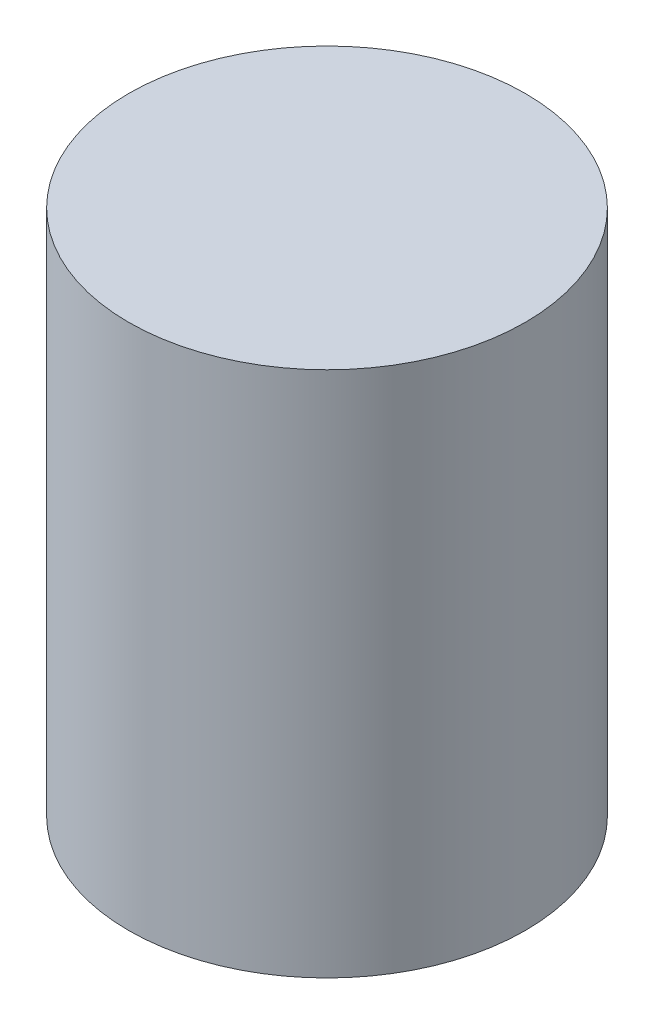
ISO-10303-21;
HEADER;
FILE_DESCRIPTION(('STEP AP214'),'2;1');
FILE_NAME('part.step','',(''),(''),'','','');
FILE_SCHEMA(('AUTOMOTIVE_DESIGN { 1 0 10303 214 1 1 1 1 }'));
ENDSEC;
DATA;
#1=APPLICATION_CONTEXT('core data for automotive mechanical design processes');
#2=APPLICATION_PROTOCOL_DEFINITION('international standard','automotive_design',2000,#1);
#3=PRODUCT_CONTEXT('',#1,'mechanical');
#4=PRODUCT('Part','Part','',(#3));
#5=PRODUCT_RELATED_PRODUCT_CATEGORY('part','',(#4));
#6=PRODUCT_DEFINITION_FORMATION('','',#4);
#7=PRODUCT_DEFINITION_CONTEXT('part definition',#1,'design');
#8=PRODUCT_DEFINITION('design','',#6,#7);
#9=PRODUCT_DEFINITION_SHAPE('','',#8);
#10=(LENGTH_UNIT() NAMED_UNIT(*) SI_UNIT(.MILLI.,.METRE.));
#11=(NAMED_UNIT(*) PLANE_ANGLE_UNIT() SI_UNIT($,.RADIAN.));
#12=(NAMED_UNIT(*) SI_UNIT($,.STERADIAN.) SOLID_ANGLE_UNIT());
#13=UNCERTAINTY_MEASURE_WITH_UNIT(LENGTH_MEASURE(1.E-05),#10,'distance_accuracy_value','');
#14=(GEOMETRIC_REPRESENTATION_CONTEXT(3) GLOBAL_UNCERTAINTY_ASSIGNED_CONTEXT((#13)) GLOBAL_UNIT_ASSIGNED_CONTEXT((#10,
#11,#12)) REPRESENTATION_CONTEXT('',''));
#15=CARTESIAN_POINT('',(0.,0.,0.));
#16=DIRECTION('',(0.,0.,1.));
#17=DIRECTION('',(1.,0.,0.));
#18=AXIS2_PLACEMENT_3D('',#15,#16,#17);
#19=CARTESIAN_POINT('',(0.,131.5,0.));
#20=DIRECTION('',(0.,-1.,0.));
#21=DIRECTION('',(0.,0.,-1.));
#22=AXIS2_PLACEMENT_3D('',#19,#20,#21);
#23=CYLINDRICAL_SURFACE('',#22,99.);
#24=CARTESIAN_POINT('',(0.,131.5,0.));
#25=DIRECTION('',(0.,1.,0.));
#26=DIRECTION('',(0.,0.,1.));
#27=AXIS2_PLACEMENT_3D('',#24,#25,#26);
#28=CIRCLE('',#27,99.);
#29=CARTESIAN_POINT('',(0.,131.5,99.));
#30=VERTEX_POINT('',#29);
#31=EDGE_CURVE('E10',#30,#30,#28,.T.);
#32=ORIENTED_EDGE('',*,*,#31,.F.);
#33=EDGE_LOOP('',(#32));
#34=FACE_BOUND('',#33,.T.);
#35=CARTESIAN_POINT('',(0.,-131.5,0.));
#36=DIRECTION('',(0.,1.,0.));
#37=DIRECTION('',(0.,0.,1.));
#38=AXIS2_PLACEMENT_3D('',#35,#36,#37);
#39=CIRCLE('',#38,99.);
#40=CARTESIAN_POINT('',(0.,-131.5,99.));
#41=VERTEX_POINT('',#40);
#42=EDGE_CURVE('E36',#41,#41,#39,.T.);
#43=ORIENTED_EDGE('',*,*,#42,.T.);
#44=EDGE_LOOP('',(#43));
#45=FACE_BOUND('',#44,.T.);
#46=ADVANCED_FACE('F33',(#34,#45),#23,.T.);
#47=CARTESIAN_POINT('',(0.,131.5,0.));
#48=DIRECTION('',(0.,1.,0.));
#49=DIRECTION('',(0.,0.,1.));
#50=AXIS2_PLACEMENT_3D('',#47,#48,#49);
#51=PLANE('',#50);
#52=ORIENTED_EDGE('',*,*,#31,.T.);
#53=EDGE_LOOP('',(#52));
#54=FACE_BOUND('',#53,.T.);
#55=ADVANCED_FACE('F48',(#54),#51,.T.);
#56=CARTESIAN_POINT('',(0.,-131.5,0.));
#57=DIRECTION('',(0.,1.,0.));
#58=DIRECTION('',(0.,0.,1.));
#59=AXIS2_PLACEMENT_3D('',#56,#57,#58);
#60=PLANE('',#59);
#61=ORIENTED_EDGE('',*,*,#42,.F.);
#62=EDGE_LOOP('',(#61));
#63=FACE_BOUND('',#62,.T.);
#64=ADVANCED_FACE('F46',(#63),#60,.F.);
#65=CLOSED_SHELL('',(#46,#55,#64));
#66=MANIFOLD_SOLID_BREP('B2',#65);
#67=ADVANCED_BREP_SHAPE_REPRESENTATION('',(#18,#66),#14);
#68=SHAPE_DEFINITION_REPRESENTATION(#9,#67);
ENDSEC;
END-ISO-10303-21;
